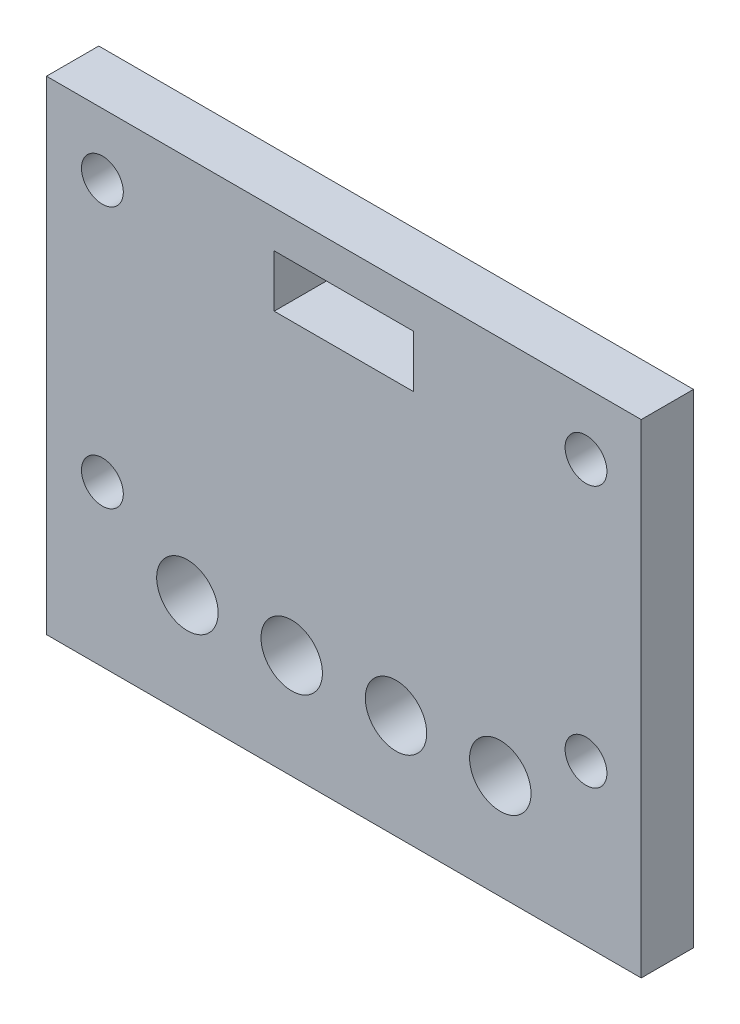
ISO-10303-21;
HEADER;
FILE_DESCRIPTION(('STEP AP214'),'2;1');
FILE_NAME('part.step','',(''),(''),'','','');
FILE_SCHEMA(('AUTOMOTIVE_DESIGN { 1 0 10303 214 1 1 1 1 }'));
ENDSEC;
DATA;
#1=APPLICATION_CONTEXT('core data for automotive mechanical design processes');
#2=APPLICATION_PROTOCOL_DEFINITION('international standard','automotive_design',2000,#1);
#3=PRODUCT_CONTEXT('',#1,'mechanical');
#4=PRODUCT('Part','Part','',(#3));
#5=PRODUCT_RELATED_PRODUCT_CATEGORY('part','',(#4));
#6=PRODUCT_DEFINITION_FORMATION('','',#4);
#7=PRODUCT_DEFINITION_CONTEXT('part definition',#1,'design');
#8=PRODUCT_DEFINITION('design','',#6,#7);
#9=PRODUCT_DEFINITION_SHAPE('','',#8);
#10=(LENGTH_UNIT() NAMED_UNIT(*) SI_UNIT(.MILLI.,.METRE.));
#11=(NAMED_UNIT(*) PLANE_ANGLE_UNIT() SI_UNIT($,.RADIAN.));
#12=(NAMED_UNIT(*) SI_UNIT($,.STERADIAN.) SOLID_ANGLE_UNIT());
#13=UNCERTAINTY_MEASURE_WITH_UNIT(LENGTH_MEASURE(1.E-05),#10,'distance_accuracy_value','');
#14=(GEOMETRIC_REPRESENTATION_CONTEXT(3) GLOBAL_UNCERTAINTY_ASSIGNED_CONTEXT((#13)) GLOBAL_UNIT_ASSIGNED_CONTEXT((#10,
#11,#12)) REPRESENTATION_CONTEXT('',''));
#15=CARTESIAN_POINT('',(0.,0.,0.));
#16=DIRECTION('',(0.,0.,1.));
#17=DIRECTION('',(1.,0.,0.));
#18=AXIS2_PLACEMENT_3D('',#15,#16,#17);
#19=CARTESIAN_POINT('',(0.,0.,4.));
#20=DIRECTION('',(0.,0.,-1.));
#21=DIRECTION('',(-1.,0.,0.));
#22=AXIS2_PLACEMENT_3D('',#19,#20,#21);
#23=PLANE('',#22);
#24=CARTESIAN_POINT('',(10.78,8.,4.));
#25=DIRECTION('',(0.,0.,1.));
#26=DIRECTION('',(1.,0.,0.));
#27=AXIS2_PLACEMENT_3D('',#24,#25,#26);
#28=CIRCLE('',#27,2.35);
#29=CARTESIAN_POINT('',(13.13,8.,4.));
#30=VERTEX_POINT('',#29);
#31=EDGE_CURVE('E219',#30,#30,#28,.T.);
#32=ORIENTED_EDGE('',*,*,#31,.F.);
#33=EDGE_LOOP('',(#32));
#34=FACE_BOUND('',#33,.T.);
#35=CARTESIAN_POINT('',(18.76,8.,4.));
#36=DIRECTION('',(0.,0.,1.));
#37=DIRECTION('',(1.,0.,0.));
#38=AXIS2_PLACEMENT_3D('',#35,#36,#37);
#39=CIRCLE('',#38,2.35);
#40=CARTESIAN_POINT('',(21.11,8.,4.));
#41=VERTEX_POINT('',#40);
#42=EDGE_CURVE('E471',#41,#41,#39,.T.);
#43=ORIENTED_EDGE('',*,*,#42,.F.);
#44=EDGE_LOOP('',(#43));
#45=FACE_BOUND('',#44,.T.);
#46=CARTESIAN_POINT('',(26.74,8.,4.));
#47=DIRECTION('',(0.,0.,1.));
#48=DIRECTION('',(1.,0.,0.));
#49=AXIS2_PLACEMENT_3D('',#46,#47,#48);
#50=CIRCLE('',#49,2.35);
#51=CARTESIAN_POINT('',(29.09,8.,4.));
#52=VERTEX_POINT('',#51);
#53=EDGE_CURVE('E473',#52,#52,#50,.T.);
#54=ORIENTED_EDGE('',*,*,#53,.F.);
#55=EDGE_LOOP('',(#54));
#56=FACE_BOUND('',#55,.T.);
#57=CARTESIAN_POINT('',(34.72,8.,4.));
#58=DIRECTION('',(0.,0.,1.));
#59=DIRECTION('',(1.,0.,0.));
#60=AXIS2_PLACEMENT_3D('',#57,#58,#59);
#61=CIRCLE('',#60,2.35);
#62=CARTESIAN_POINT('',(37.07,8.,4.));
#63=VERTEX_POINT('',#62);
#64=EDGE_CURVE('E481',#63,#63,#61,.T.);
#65=ORIENTED_EDGE('',*,*,#64,.F.);
#66=EDGE_LOOP('',(#65));
#67=FACE_BOUND('',#66,.T.);
#68=CARTESIAN_POINT('',(4.27584890969045,32.2525920824198,4.));
#69=DIRECTION('',(0.,0.,-1.));
#70=DIRECTION('',(-1.,0.,0.));
#71=AXIS2_PLACEMENT_3D('',#68,#69,#70);
#72=CIRCLE('',#71,1.6);
#73=CARTESIAN_POINT('',(2.67584890969045,32.2525920824198,4.));
#74=VERTEX_POINT('',#73);
#75=EDGE_CURVE('E143',#74,#74,#72,.T.);
#76=ORIENTED_EDGE('',*,*,#75,.T.);
#77=EDGE_LOOP('',(#76));
#78=FACE_BOUND('',#77,.T.);
#79=CARTESIAN_POINT('',(4.27584890969045,12.2525920824197,4.));
#80=DIRECTION('',(0.,0.,-1.));
#81=DIRECTION('',(-1.,0.,0.));
#82=AXIS2_PLACEMENT_3D('',#79,#80,#81);
#83=CIRCLE('',#82,1.6);
#84=CARTESIAN_POINT('',(2.67584890969045,12.2525920824197,4.));
#85=VERTEX_POINT('',#84);
#86=EDGE_CURVE('E209',#85,#85,#83,.T.);
#87=ORIENTED_EDGE('',*,*,#86,.T.);
#88=EDGE_LOOP('',(#87));
#89=FACE_BOUND('',#88,.T.);
#90=CARTESIAN_POINT('',(41.2758489096904,12.2525920824197,4.));
#91=DIRECTION('',(0.,0.,-1.));
#92=DIRECTION('',(-1.,0.,0.));
#93=AXIS2_PLACEMENT_3D('',#90,#91,#92);
#94=CIRCLE('',#93,1.6);
#95=CARTESIAN_POINT('',(39.6758489096904,12.2525920824197,4.));
#96=VERTEX_POINT('',#95);
#97=EDGE_CURVE('E204',#96,#96,#94,.T.);
#98=ORIENTED_EDGE('',*,*,#97,.T.);
#99=EDGE_LOOP('',(#98));
#100=FACE_BOUND('',#99,.T.);
#101=CARTESIAN_POINT('',(41.2758489096905,32.2525920824197,4.));
#102=DIRECTION('',(0.,0.,-1.));
#103=DIRECTION('',(-1.,0.,0.));
#104=AXIS2_PLACEMENT_3D('',#101,#102,#103);
#105=CIRCLE('',#104,1.60000000000001);
#106=CARTESIAN_POINT('',(39.6758489096904,32.2525920824197,4.));
#107=VERTEX_POINT('',#106);
#108=EDGE_CURVE('E199',#107,#107,#105,.T.);
#109=ORIENTED_EDGE('',*,*,#108,.T.);
#110=EDGE_LOOP('',(#109));
#111=FACE_BOUND('',#110,.T.);
#112=DIRECTION('',(0.,-1.,0.));
#113=VECTOR('',#112,1.);
#114=CARTESIAN_POINT('',(0.,0.,4.));
#115=LINE('',#114,#113);
#116=CARTESIAN_POINT('',(0.,37.,4.));
#117=VERTEX_POINT('',#116);
#118=CARTESIAN_POINT('',(0.,0.,4.));
#119=VERTEX_POINT('',#118);
#120=EDGE_CURVE('E159',#117,#119,#115,.T.);
#121=ORIENTED_EDGE('',*,*,#120,.T.);
#122=DIRECTION('',(1.,0.,0.));
#123=VECTOR('',#122,1.);
#124=CARTESIAN_POINT('',(0.,0.,4.));
#125=LINE('',#124,#123);
#126=CARTESIAN_POINT('',(45.5,0.,4.));
#127=VERTEX_POINT('',#126);
#128=EDGE_CURVE('E163',#119,#127,#125,.T.);
#129=ORIENTED_EDGE('',*,*,#128,.T.);
#130=DIRECTION('',(0.,1.,0.));
#131=VECTOR('',#130,1.);
#132=CARTESIAN_POINT('',(45.5,0.,4.));
#133=LINE('',#132,#131);
#134=CARTESIAN_POINT('',(45.5,37.,4.));
#135=VERTEX_POINT('',#134);
#136=EDGE_CURVE('E167',#127,#135,#133,.T.);
#137=ORIENTED_EDGE('',*,*,#136,.T.);
#138=DIRECTION('',(-1.,0.,0.));
#139=VECTOR('',#138,1.);
#140=CARTESIAN_POINT('',(0.,37.,4.));
#141=LINE('',#140,#139);
#142=EDGE_CURVE('E170',#135,#117,#141,.T.);
#143=ORIENTED_EDGE('',*,*,#142,.T.);
#144=EDGE_LOOP('',(#121,#129,#137,#143));
#145=FACE_BOUND('',#144,.T.);
#146=DIRECTION('',(0.,-1.,0.));
#147=VECTOR('',#146,1.);
#148=CARTESIAN_POINT('',(17.42,34.14,4.));
#149=LINE('',#148,#147);
#150=CARTESIAN_POINT('',(17.42,34.14,4.));
#151=VERTEX_POINT('',#150);
#152=CARTESIAN_POINT('',(17.42,30.14,4.));
#153=VERTEX_POINT('',#152);
#154=EDGE_CURVE('E108',#151,#153,#149,.T.);
#155=ORIENTED_EDGE('',*,*,#154,.F.);
#156=DIRECTION('',(-1.,0.,0.));
#157=VECTOR('',#156,1.);
#158=CARTESIAN_POINT('',(17.42,34.14,4.));
#159=LINE('',#158,#157);
#160=CARTESIAN_POINT('',(28.08,34.14,4.));
#161=VERTEX_POINT('',#160);
#162=EDGE_CURVE('E135',#161,#151,#159,.T.);
#163=ORIENTED_EDGE('',*,*,#162,.F.);
#164=DIRECTION('',(0.,1.,0.));
#165=VECTOR('',#164,1.);
#166=CARTESIAN_POINT('',(28.08,34.14,4.));
#167=LINE('',#166,#165);
#168=CARTESIAN_POINT('',(28.08,30.14,4.));
#169=VERTEX_POINT('',#168);
#170=EDGE_CURVE('E130',#169,#161,#167,.T.);
#171=ORIENTED_EDGE('',*,*,#170,.F.);
#172=DIRECTION('',(1.,0.,0.));
#173=VECTOR('',#172,1.);
#174=CARTESIAN_POINT('',(17.42,30.14,4.));
#175=LINE('',#174,#173);
#176=EDGE_CURVE('E117',#153,#169,#175,.T.);
#177=ORIENTED_EDGE('',*,*,#176,.F.);
#178=EDGE_LOOP('',(#155,#163,#171,#177));
#179=FACE_BOUND('',#178,.T.);
#180=ADVANCED_FACE('F40',(#34,#45,#56,#67,#78,#89,#100,#111,#145,#179),#23,.F.);
#181=CARTESIAN_POINT('',(0.,0.,0.));
#182=DIRECTION('',(0.,0.,-1.));
#183=DIRECTION('',(-1.,0.,0.));
#184=AXIS2_PLACEMENT_3D('',#181,#182,#183);
#185=PLANE('',#184);
#186=CARTESIAN_POINT('',(10.78,8.,0.));
#187=DIRECTION('',(0.,0.,-1.));
#188=DIRECTION('',(-1.,0.,0.));
#189=AXIS2_PLACEMENT_3D('',#186,#187,#188);
#190=CIRCLE('',#189,2.35);
#191=CARTESIAN_POINT('',(8.43,8.,0.));
#192=VERTEX_POINT('',#191);
#193=EDGE_CURVE('E44',#192,#192,#190,.T.);
#194=ORIENTED_EDGE('',*,*,#193,.F.);
#195=EDGE_LOOP('',(#194));
#196=FACE_BOUND('',#195,.T.);
#197=CARTESIAN_POINT('',(18.76,8.,0.));
#198=DIRECTION('',(0.,0.,-1.));
#199=DIRECTION('',(-1.,0.,0.));
#200=AXIS2_PLACEMENT_3D('',#197,#198,#199);
#201=CIRCLE('',#200,2.35);
#202=CARTESIAN_POINT('',(16.41,8.,0.));
#203=VERTEX_POINT('',#202);
#204=EDGE_CURVE('E222',#203,#203,#201,.T.);
#205=ORIENTED_EDGE('',*,*,#204,.F.);
#206=EDGE_LOOP('',(#205));
#207=FACE_BOUND('',#206,.T.);
#208=CARTESIAN_POINT('',(26.74,8.,0.));
#209=DIRECTION('',(0.,0.,-1.));
#210=DIRECTION('',(-1.,0.,0.));
#211=AXIS2_PLACEMENT_3D('',#208,#209,#210);
#212=CIRCLE('',#211,2.35);
#213=CARTESIAN_POINT('',(24.39,8.,0.));
#214=VERTEX_POINT('',#213);
#215=EDGE_CURVE('E218',#214,#214,#212,.T.);
#216=ORIENTED_EDGE('',*,*,#215,.F.);
#217=EDGE_LOOP('',(#216));
#218=FACE_BOUND('',#217,.T.);
#219=CARTESIAN_POINT('',(34.72,8.,0.));
#220=DIRECTION('',(0.,0.,-1.));
#221=DIRECTION('',(-1.,0.,0.));
#222=AXIS2_PLACEMENT_3D('',#219,#220,#221);
#223=CIRCLE('',#222,2.35);
#224=CARTESIAN_POINT('',(32.37,8.,0.));
#225=VERTEX_POINT('',#224);
#226=EDGE_CURVE('E214',#225,#225,#223,.T.);
#227=ORIENTED_EDGE('',*,*,#226,.F.);
#228=EDGE_LOOP('',(#227));
#229=FACE_BOUND('',#228,.T.);
#230=CARTESIAN_POINT('',(4.27584890969045,32.2525920824198,0.));
#231=DIRECTION('',(0.,0.,-1.));
#232=DIRECTION('',(-1.,0.,0.));
#233=AXIS2_PLACEMENT_3D('',#230,#231,#232);
#234=CIRCLE('',#233,1.6);
#235=CARTESIAN_POINT('',(2.67584890969045,32.2525920824198,0.));
#236=VERTEX_POINT('',#235);
#237=EDGE_CURVE('E210',#236,#236,#234,.T.);
#238=ORIENTED_EDGE('',*,*,#237,.F.);
#239=EDGE_LOOP('',(#238));
#240=FACE_BOUND('',#239,.T.);
#241=CARTESIAN_POINT('',(4.27584890969045,12.2525920824197,0.));
#242=DIRECTION('',(0.,0.,-1.));
#243=DIRECTION('',(-1.,0.,0.));
#244=AXIS2_PLACEMENT_3D('',#241,#242,#243);
#245=CIRCLE('',#244,1.6);
#246=CARTESIAN_POINT('',(2.67584890969045,12.2525920824197,0.));
#247=VERTEX_POINT('',#246);
#248=EDGE_CURVE('E205',#247,#247,#245,.T.);
#249=ORIENTED_EDGE('',*,*,#248,.F.);
#250=EDGE_LOOP('',(#249));
#251=FACE_BOUND('',#250,.T.);
#252=CARTESIAN_POINT('',(41.2758489096904,12.2525920824197,0.));
#253=DIRECTION('',(0.,0.,-1.));
#254=DIRECTION('',(-1.,0.,0.));
#255=AXIS2_PLACEMENT_3D('',#252,#253,#254);
#256=CIRCLE('',#255,1.6);
#257=CARTESIAN_POINT('',(39.6758489096904,12.2525920824197,0.));
#258=VERTEX_POINT('',#257);
#259=EDGE_CURVE('E200',#258,#258,#256,.T.);
#260=ORIENTED_EDGE('',*,*,#259,.F.);
#261=EDGE_LOOP('',(#260));
#262=FACE_BOUND('',#261,.T.);
#263=CARTESIAN_POINT('',(41.2758489096905,32.2525920824197,0.));
#264=DIRECTION('',(0.,0.,-1.));
#265=DIRECTION('',(-1.,0.,0.));
#266=AXIS2_PLACEMENT_3D('',#263,#264,#265);
#267=CIRCLE('',#266,1.60000000000001);
#268=CARTESIAN_POINT('',(39.6758489096904,32.2525920824197,0.));
#269=VERTEX_POINT('',#268);
#270=EDGE_CURVE('E195',#269,#269,#267,.T.);
#271=ORIENTED_EDGE('',*,*,#270,.F.);
#272=EDGE_LOOP('',(#271));
#273=FACE_BOUND('',#272,.T.);
#274=DIRECTION('',(0.,-1.,0.));
#275=VECTOR('',#274,1.);
#276=CARTESIAN_POINT('',(0.,0.,0.));
#277=LINE('',#276,#275);
#278=CARTESIAN_POINT('',(0.,37.,0.));
#279=VERTEX_POINT('',#278);
#280=CARTESIAN_POINT('',(0.,0.,0.));
#281=VERTEX_POINT('',#280);
#282=EDGE_CURVE('E126',#279,#281,#277,.T.);
#283=ORIENTED_EDGE('',*,*,#282,.F.);
#284=DIRECTION('',(-1.,0.,0.));
#285=VECTOR('',#284,1.);
#286=CARTESIAN_POINT('',(0.,37.,0.));
#287=LINE('',#286,#285);
#288=CARTESIAN_POINT('',(45.5,37.,0.));
#289=VERTEX_POINT('',#288);
#290=EDGE_CURVE('E164',#289,#279,#287,.T.);
#291=ORIENTED_EDGE('',*,*,#290,.F.);
#292=DIRECTION('',(0.,1.,0.));
#293=VECTOR('',#292,1.);
#294=CARTESIAN_POINT('',(45.5,0.,0.));
#295=LINE('',#294,#293);
#296=CARTESIAN_POINT('',(45.5,0.,0.));
#297=VERTEX_POINT('',#296);
#298=EDGE_CURVE('E180',#297,#289,#295,.T.);
#299=ORIENTED_EDGE('',*,*,#298,.F.);
#300=DIRECTION('',(1.,0.,0.));
#301=VECTOR('',#300,1.);
#302=CARTESIAN_POINT('',(0.,0.,0.));
#303=LINE('',#302,#301);
#304=EDGE_CURVE('E177',#281,#297,#303,.T.);
#305=ORIENTED_EDGE('',*,*,#304,.F.);
#306=EDGE_LOOP('',(#283,#291,#299,#305));
#307=FACE_BOUND('',#306,.T.);
#308=DIRECTION('',(-1.,0.,0.));
#309=VECTOR('',#308,1.);
#310=CARTESIAN_POINT('',(17.42,34.14,0.));
#311=LINE('',#310,#309);
#312=CARTESIAN_POINT('',(28.08,34.14,0.));
#313=VERTEX_POINT('',#312);
#314=CARTESIAN_POINT('',(17.42,34.14,0.));
#315=VERTEX_POINT('',#314);
#316=EDGE_CURVE('E118',#313,#315,#311,.T.);
#317=ORIENTED_EDGE('',*,*,#316,.T.);
#318=DIRECTION('',(0.,-1.,0.));
#319=VECTOR('',#318,1.);
#320=CARTESIAN_POINT('',(17.42,34.14,0.));
#321=LINE('',#320,#319);
#322=CARTESIAN_POINT('',(17.42,30.14,0.));
#323=VERTEX_POINT('',#322);
#324=EDGE_CURVE('E66',#315,#323,#321,.T.);
#325=ORIENTED_EDGE('',*,*,#324,.T.);
#326=DIRECTION('',(1.,0.,0.));
#327=VECTOR('',#326,1.);
#328=CARTESIAN_POINT('',(17.42,30.14,0.));
#329=LINE('',#328,#327);
#330=CARTESIAN_POINT('',(28.08,30.14,0.));
#331=VERTEX_POINT('',#330);
#332=EDGE_CURVE('E124',#323,#331,#329,.T.);
#333=ORIENTED_EDGE('',*,*,#332,.T.);
#334=DIRECTION('',(0.,1.,0.));
#335=VECTOR('',#334,1.);
#336=CARTESIAN_POINT('',(28.08,34.14,0.));
#337=LINE('',#336,#335);
#338=EDGE_CURVE('E146',#331,#313,#337,.T.);
#339=ORIENTED_EDGE('',*,*,#338,.T.);
#340=EDGE_LOOP('',(#317,#325,#333,#339));
#341=FACE_BOUND('',#340,.T.);
#342=ADVANCED_FACE('F236',(#196,#207,#218,#229,#240,#251,#262,#273,#307,#341),#185,.T.);
#343=CARTESIAN_POINT('',(0.,0.,4.));
#344=DIRECTION('',(1.,0.,0.));
#345=DIRECTION('',(0.,0.,-1.));
#346=AXIS2_PLACEMENT_3D('',#343,#344,#345);
#347=PLANE('',#346);
#348=ORIENTED_EDGE('',*,*,#282,.T.);
#349=DIRECTION('',(0.,0.,-1.));
#350=VECTOR('',#349,1.);
#351=CARTESIAN_POINT('',(0.,0.,4.));
#352=LINE('',#351,#350);
#353=EDGE_CURVE('E11',#119,#281,#352,.T.);
#354=ORIENTED_EDGE('',*,*,#353,.F.);
#355=ORIENTED_EDGE('',*,*,#120,.F.);
#356=DIRECTION('',(0.,0.,-1.));
#357=VECTOR('',#356,1.);
#358=CARTESIAN_POINT('',(0.,37.,4.));
#359=LINE('',#358,#357);
#360=EDGE_CURVE('E173',#117,#279,#359,.T.);
#361=ORIENTED_EDGE('',*,*,#360,.T.);
#362=EDGE_LOOP('',(#348,#354,#355,#361));
#363=FACE_BOUND('',#362,.T.);
#364=ADVANCED_FACE('F42',(#363),#347,.F.);
#365=CARTESIAN_POINT('',(0.,0.,4.));
#366=DIRECTION('',(0.,1.,0.));
#367=DIRECTION('',(0.,0.,1.));
#368=AXIS2_PLACEMENT_3D('',#365,#366,#367);
#369=PLANE('',#368);
#370=ORIENTED_EDGE('',*,*,#304,.T.);
#371=DIRECTION('',(0.,0.,-1.));
#372=VECTOR('',#371,1.);
#373=CARTESIAN_POINT('',(45.5,0.,4.));
#374=LINE('',#373,#372);
#375=EDGE_CURVE('E50',#127,#297,#374,.T.);
#376=ORIENTED_EDGE('',*,*,#375,.F.);
#377=ORIENTED_EDGE('',*,*,#128,.F.);
#378=ORIENTED_EDGE('',*,*,#353,.T.);
#379=EDGE_LOOP('',(#370,#376,#377,#378));
#380=FACE_BOUND('',#379,.T.);
#381=ADVANCED_FACE('F287',(#380),#369,.F.);
#382=CARTESIAN_POINT('',(45.5,0.,4.));
#383=DIRECTION('',(-1.,0.,0.));
#384=DIRECTION('',(0.,0.,1.));
#385=AXIS2_PLACEMENT_3D('',#382,#383,#384);
#386=PLANE('',#385);
#387=ORIENTED_EDGE('',*,*,#298,.T.);
#388=DIRECTION('',(0.,0.,-1.));
#389=VECTOR('',#388,1.);
#390=CARTESIAN_POINT('',(45.5,37.,4.));
#391=LINE('',#390,#389);
#392=EDGE_CURVE('E188',#135,#289,#391,.T.);
#393=ORIENTED_EDGE('',*,*,#392,.F.);
#394=ORIENTED_EDGE('',*,*,#136,.F.);
#395=ORIENTED_EDGE('',*,*,#375,.T.);
#396=EDGE_LOOP('',(#387,#393,#394,#395));
#397=FACE_BOUND('',#396,.T.);
#398=ADVANCED_FACE('F284',(#397),#386,.F.);
#399=CARTESIAN_POINT('',(0.,37.,4.));
#400=DIRECTION('',(0.,-1.,0.));
#401=DIRECTION('',(0.,0.,-1.));
#402=AXIS2_PLACEMENT_3D('',#399,#400,#401);
#403=PLANE('',#402);
#404=ORIENTED_EDGE('',*,*,#290,.T.);
#405=ORIENTED_EDGE('',*,*,#360,.F.);
#406=ORIENTED_EDGE('',*,*,#142,.F.);
#407=ORIENTED_EDGE('',*,*,#392,.T.);
#408=EDGE_LOOP('',(#404,#405,#406,#407));
#409=FACE_BOUND('',#408,.T.);
#410=ADVANCED_FACE('F281',(#409),#403,.F.);
#411=CARTESIAN_POINT('',(17.42,34.14,4.));
#412=DIRECTION('',(1.,0.,0.));
#413=DIRECTION('',(0.,1.,0.));
#414=AXIS2_PLACEMENT_3D('',#411,#412,#413);
#415=PLANE('',#414);
#416=ORIENTED_EDGE('',*,*,#324,.F.);
#417=DIRECTION('',(0.,0.,-1.));
#418=VECTOR('',#417,1.);
#419=CARTESIAN_POINT('',(17.42,34.14,4.));
#420=LINE('',#419,#418);
#421=EDGE_CURVE('E112',#151,#315,#420,.T.);
#422=ORIENTED_EDGE('',*,*,#421,.F.);
#423=ORIENTED_EDGE('',*,*,#154,.T.);
#424=DIRECTION('',(0.,0.,-1.));
#425=VECTOR('',#424,1.);
#426=CARTESIAN_POINT('',(17.42,30.14,4.));
#427=LINE('',#426,#425);
#428=EDGE_CURVE('E111',#153,#323,#427,.T.);
#429=ORIENTED_EDGE('',*,*,#428,.T.);
#430=EDGE_LOOP('',(#416,#422,#423,#429));
#431=FACE_BOUND('',#430,.T.);
#432=ADVANCED_FACE('F110',(#431),#415,.T.);
#433=CARTESIAN_POINT('',(17.42,30.14,4.));
#434=DIRECTION('',(0.,1.,0.));
#435=DIRECTION('',(0.,0.,1.));
#436=AXIS2_PLACEMENT_3D('',#433,#434,#435);
#437=PLANE('',#436);
#438=ORIENTED_EDGE('',*,*,#332,.F.);
#439=ORIENTED_EDGE('',*,*,#428,.F.);
#440=ORIENTED_EDGE('',*,*,#176,.T.);
#441=DIRECTION('',(0.,0.,-1.));
#442=VECTOR('',#441,1.);
#443=CARTESIAN_POINT('',(28.08,30.14,4.));
#444=LINE('',#443,#442);
#445=EDGE_CURVE('E127',#169,#331,#444,.T.);
#446=ORIENTED_EDGE('',*,*,#445,.T.);
#447=EDGE_LOOP('',(#438,#439,#440,#446));
#448=FACE_BOUND('',#447,.T.);
#449=ADVANCED_FACE('F121',(#448),#437,.T.);
#450=CARTESIAN_POINT('',(28.08,34.14,4.));
#451=DIRECTION('',(-1.,0.,0.));
#452=DIRECTION('',(0.,0.,1.));
#453=AXIS2_PLACEMENT_3D('',#450,#451,#452);
#454=PLANE('',#453);
#455=ORIENTED_EDGE('',*,*,#338,.F.);
#456=ORIENTED_EDGE('',*,*,#445,.F.);
#457=ORIENTED_EDGE('',*,*,#170,.T.);
#458=DIRECTION('',(0.,0.,-1.));
#459=VECTOR('',#458,1.);
#460=CARTESIAN_POINT('',(28.08,34.14,4.));
#461=LINE('',#460,#459);
#462=EDGE_CURVE('E58',#161,#313,#461,.T.);
#463=ORIENTED_EDGE('',*,*,#462,.T.);
#464=EDGE_LOOP('',(#455,#456,#457,#463));
#465=FACE_BOUND('',#464,.T.);
#466=ADVANCED_FACE('F260',(#465),#454,.T.);
#467=CARTESIAN_POINT('',(17.42,34.14,4.));
#468=DIRECTION('',(0.,-1.,0.));
#469=DIRECTION('',(1.,0.,0.));
#470=AXIS2_PLACEMENT_3D('',#467,#468,#469);
#471=PLANE('',#470);
#472=ORIENTED_EDGE('',*,*,#316,.F.);
#473=ORIENTED_EDGE('',*,*,#462,.F.);
#474=ORIENTED_EDGE('',*,*,#162,.T.);
#475=ORIENTED_EDGE('',*,*,#421,.T.);
#476=EDGE_LOOP('',(#472,#473,#474,#475));
#477=FACE_BOUND('',#476,.T.);
#478=ADVANCED_FACE('F257',(#477),#471,.T.);
#479=CARTESIAN_POINT('',(41.2758489096905,32.2525920824197,-1.2E-05));
#480=DIRECTION('',(0.,0.,1.));
#481=DIRECTION('',(1.,0.,0.));
#482=AXIS2_PLACEMENT_3D('',#479,#480,#481);
#483=CYLINDRICAL_SURFACE('',#482,1.60000000000001);
#484=ORIENTED_EDGE('',*,*,#270,.T.);
#485=EDGE_LOOP('',(#484));
#486=FACE_BOUND('',#485,.T.);
#487=ORIENTED_EDGE('',*,*,#108,.F.);
#488=EDGE_LOOP('',(#487));
#489=FACE_BOUND('',#488,.T.);
#490=ADVANCED_FACE('F259',(#486,#489),#483,.F.);
#491=CARTESIAN_POINT('',(41.2758489096904,12.2525920824197,-1.2E-05));
#492=DIRECTION('',(0.,0.,1.));
#493=DIRECTION('',(1.,0.,0.));
#494=AXIS2_PLACEMENT_3D('',#491,#492,#493);
#495=CYLINDRICAL_SURFACE('',#494,1.6);
#496=ORIENTED_EDGE('',*,*,#259,.T.);
#497=EDGE_LOOP('',(#496));
#498=FACE_BOUND('',#497,.T.);
#499=ORIENTED_EDGE('',*,*,#97,.F.);
#500=EDGE_LOOP('',(#499));
#501=FACE_BOUND('',#500,.T.);
#502=ADVANCED_FACE('F266',(#498,#501),#495,.F.);
#503=CARTESIAN_POINT('',(4.27584890969045,12.2525920824197,-1.2E-05));
#504=DIRECTION('',(0.,0.,1.));
#505=DIRECTION('',(1.,0.,0.));
#506=AXIS2_PLACEMENT_3D('',#503,#504,#505);
#507=CYLINDRICAL_SURFACE('',#506,1.6);
#508=ORIENTED_EDGE('',*,*,#248,.T.);
#509=EDGE_LOOP('',(#508));
#510=FACE_BOUND('',#509,.T.);
#511=ORIENTED_EDGE('',*,*,#86,.F.);
#512=EDGE_LOOP('',(#511));
#513=FACE_BOUND('',#512,.T.);
#514=ADVANCED_FACE('F329',(#510,#513),#507,.F.);
#515=CARTESIAN_POINT('',(4.27584890969045,32.2525920824198,-1.2E-05));
#516=DIRECTION('',(0.,0.,1.));
#517=DIRECTION('',(1.,0.,0.));
#518=AXIS2_PLACEMENT_3D('',#515,#516,#517);
#519=CYLINDRICAL_SURFACE('',#518,1.6);
#520=ORIENTED_EDGE('',*,*,#237,.T.);
#521=EDGE_LOOP('',(#520));
#522=FACE_BOUND('',#521,.T.);
#523=ORIENTED_EDGE('',*,*,#75,.F.);
#524=EDGE_LOOP('',(#523));
#525=FACE_BOUND('',#524,.T.);
#526=ADVANCED_FACE('F322',(#522,#525),#519,.F.);
#527=CARTESIAN_POINT('',(34.72,8.,-6.));
#528=DIRECTION('',(0.,0.,1.));
#529=DIRECTION('',(1.,0.,0.));
#530=AXIS2_PLACEMENT_3D('',#527,#528,#529);
#531=CYLINDRICAL_SURFACE('',#530,2.35);
#532=ORIENTED_EDGE('',*,*,#226,.T.);
#533=EDGE_LOOP('',(#532));
#534=FACE_BOUND('',#533,.T.);
#535=ORIENTED_EDGE('',*,*,#64,.T.);
#536=EDGE_LOOP('',(#535));
#537=FACE_BOUND('',#536,.T.);
#538=ADVANCED_FACE('F328',(#534,#537),#531,.F.);
#539=CARTESIAN_POINT('',(26.74,8.,-6.));
#540=DIRECTION('',(0.,0.,1.));
#541=DIRECTION('',(1.,0.,0.));
#542=AXIS2_PLACEMENT_3D('',#539,#540,#541);
#543=CYLINDRICAL_SURFACE('',#542,2.35);
#544=ORIENTED_EDGE('',*,*,#215,.T.);
#545=EDGE_LOOP('',(#544));
#546=FACE_BOUND('',#545,.T.);
#547=ORIENTED_EDGE('',*,*,#53,.T.);
#548=EDGE_LOOP('',(#547));
#549=FACE_BOUND('',#548,.T.);
#550=ADVANCED_FACE('F430',(#546,#549),#543,.F.);
#551=CARTESIAN_POINT('',(18.76,8.,-6.));
#552=DIRECTION('',(0.,0.,1.));
#553=DIRECTION('',(1.,0.,0.));
#554=AXIS2_PLACEMENT_3D('',#551,#552,#553);
#555=CYLINDRICAL_SURFACE('',#554,2.35);
#556=ORIENTED_EDGE('',*,*,#204,.T.);
#557=EDGE_LOOP('',(#556));
#558=FACE_BOUND('',#557,.T.);
#559=ORIENTED_EDGE('',*,*,#42,.T.);
#560=EDGE_LOOP('',(#559));
#561=FACE_BOUND('',#560,.T.);
#562=ADVANCED_FACE('F437',(#558,#561),#555,.F.);
#563=CARTESIAN_POINT('',(10.78,8.,-6.));
#564=DIRECTION('',(0.,0.,1.));
#565=DIRECTION('',(1.,0.,0.));
#566=AXIS2_PLACEMENT_3D('',#563,#564,#565);
#567=CYLINDRICAL_SURFACE('',#566,2.35);
#568=ORIENTED_EDGE('',*,*,#193,.T.);
#569=EDGE_LOOP('',(#568));
#570=FACE_BOUND('',#569,.T.);
#571=ORIENTED_EDGE('',*,*,#31,.T.);
#572=EDGE_LOOP('',(#571));
#573=FACE_BOUND('',#572,.T.);
#574=ADVANCED_FACE('F233',(#570,#573),#567,.F.);
#575=CLOSED_SHELL('',(#180,#342,#364,#381,#398,#410,#432,#449,#466,#478,#490,#502,#514,#526,
#538,#550,#562,#574));
#576=MANIFOLD_SOLID_BREP('B2',#575);
#577=ADVANCED_BREP_SHAPE_REPRESENTATION('',(#18,#576),#14);
#578=SHAPE_DEFINITION_REPRESENTATION(#9,#577);
ENDSEC;
END-ISO-10303-21;
